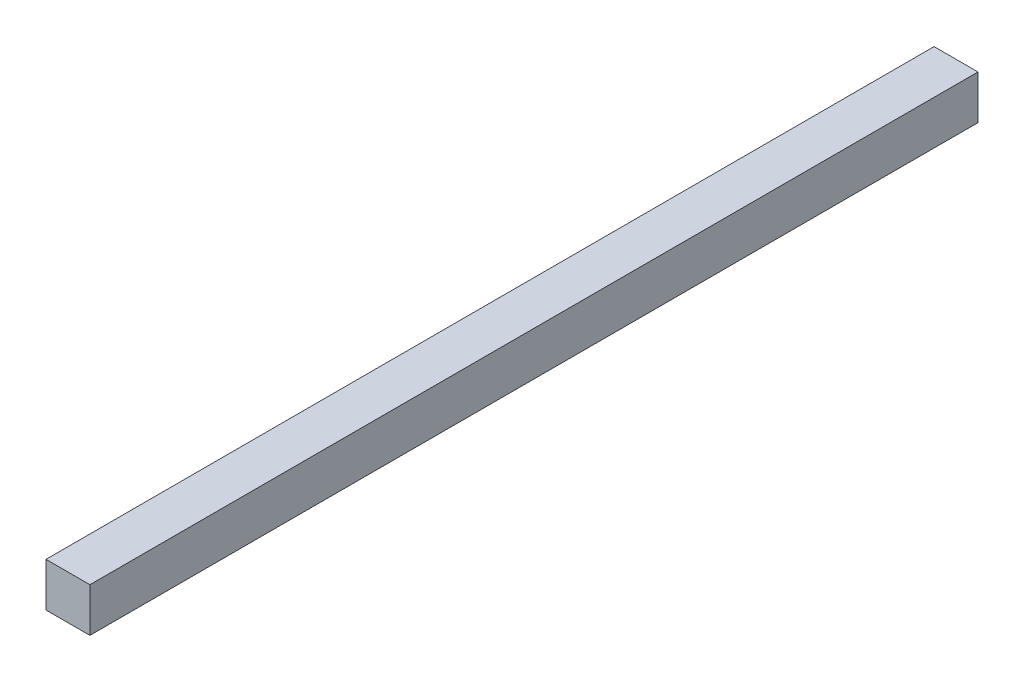
ISO-10303-21;
HEADER;
FILE_DESCRIPTION(('STEP AP214'),'2;1');
FILE_NAME('part.step','',(''),(''),'','','');
FILE_SCHEMA(('AUTOMOTIVE_DESIGN { 1 0 10303 214 1 1 1 1 }'));
ENDSEC;
DATA;
#1=APPLICATION_CONTEXT('core data for automotive mechanical design processes');
#2=APPLICATION_PROTOCOL_DEFINITION('international standard','automotive_design',2000,#1);
#3=PRODUCT_CONTEXT('',#1,'mechanical');
#4=PRODUCT('Part','Part','',(#3));
#5=PRODUCT_RELATED_PRODUCT_CATEGORY('part','',(#4));
#6=PRODUCT_DEFINITION_FORMATION('','',#4);
#7=PRODUCT_DEFINITION_CONTEXT('part definition',#1,'design');
#8=PRODUCT_DEFINITION('design','',#6,#7);
#9=PRODUCT_DEFINITION_SHAPE('','',#8);
#10=(LENGTH_UNIT() NAMED_UNIT(*) SI_UNIT(.MILLI.,.METRE.));
#11=(NAMED_UNIT(*) PLANE_ANGLE_UNIT() SI_UNIT($,.RADIAN.));
#12=(NAMED_UNIT(*) SI_UNIT($,.STERADIAN.) SOLID_ANGLE_UNIT());
#13=UNCERTAINTY_MEASURE_WITH_UNIT(LENGTH_MEASURE(1.E-05),#10,'distance_accuracy_value','');
#14=(GEOMETRIC_REPRESENTATION_CONTEXT(3) GLOBAL_UNCERTAINTY_ASSIGNED_CONTEXT((#13)) GLOBAL_UNIT_ASSIGNED_CONTEXT((#10,
#11,#12)) REPRESENTATION_CONTEXT('',''));
#15=CARTESIAN_POINT('',(0.,0.,0.));
#16=DIRECTION('',(0.,0.,1.));
#17=DIRECTION('',(1.,0.,0.));
#18=AXIS2_PLACEMENT_3D('',#15,#16,#17);
#19=CARTESIAN_POINT('',(0.,0.,910.));
#20=DIRECTION('',(1.,0.,0.));
#21=DIRECTION('',(0.,0.,-1.));
#22=AXIS2_PLACEMENT_3D('',#19,#20,#21);
#23=PLANE('',#22);
#24=DIRECTION('',(0.,-1.,0.));
#25=VECTOR('',#24,1.);
#26=CARTESIAN_POINT('',(0.,0.,0.));
#27=LINE('',#26,#25);
#28=CARTESIAN_POINT('',(0.,45.,0.));
#29=VERTEX_POINT('',#28);
#30=CARTESIAN_POINT('',(0.,0.,0.));
#31=VERTEX_POINT('',#30);
#32=EDGE_CURVE('E107',#29,#31,#27,.T.);
#33=ORIENTED_EDGE('',*,*,#32,.T.);
#34=DIRECTION('',(0.,0.,-1.));
#35=VECTOR('',#34,1.);
#36=CARTESIAN_POINT('',(0.,0.,910.));
#37=LINE('',#36,#35);
#38=CARTESIAN_POINT('',(0.,0.,910.));
#39=VERTEX_POINT('',#38);
#40=EDGE_CURVE('E11',#39,#31,#37,.T.);
#41=ORIENTED_EDGE('',*,*,#40,.F.);
#42=DIRECTION('',(0.,-1.,0.));
#43=VECTOR('',#42,1.);
#44=CARTESIAN_POINT('',(0.,0.,910.));
#45=LINE('',#44,#43);
#46=CARTESIAN_POINT('',(0.,45.,910.));
#47=VERTEX_POINT('',#46);
#48=EDGE_CURVE('E91',#47,#39,#45,.T.);
#49=ORIENTED_EDGE('',*,*,#48,.F.);
#50=DIRECTION('',(0.,0.,-1.));
#51=VECTOR('',#50,1.);
#52=CARTESIAN_POINT('',(0.,45.,910.));
#53=LINE('',#52,#51);
#54=EDGE_CURVE('E103',#47,#29,#53,.T.);
#55=ORIENTED_EDGE('',*,*,#54,.T.);
#56=EDGE_LOOP('',(#33,#41,#49,#55));
#57=FACE_BOUND('',#56,.T.);
#58=ADVANCED_FACE('F39',(#57),#23,.F.);
#59=CARTESIAN_POINT('',(0.,0.,910.));
#60=DIRECTION('',(0.,1.,0.));
#61=DIRECTION('',(0.,0.,1.));
#62=AXIS2_PLACEMENT_3D('',#59,#60,#61);
#63=PLANE('',#62);
#64=DIRECTION('',(1.,0.,0.));
#65=VECTOR('',#64,1.);
#66=CARTESIAN_POINT('',(0.,0.,0.));
#67=LINE('',#66,#65);
#68=CARTESIAN_POINT('',(45.,0.,0.));
#69=VERTEX_POINT('',#68);
#70=EDGE_CURVE('E96',#31,#69,#67,.T.);
#71=ORIENTED_EDGE('',*,*,#70,.T.);
#72=DIRECTION('',(0.,0.,-1.));
#73=VECTOR('',#72,1.);
#74=CARTESIAN_POINT('',(45.,0.,910.));
#75=LINE('',#74,#73);
#76=CARTESIAN_POINT('',(45.,0.,910.));
#77=VERTEX_POINT('',#76);
#78=EDGE_CURVE('E48',#77,#69,#75,.T.);
#79=ORIENTED_EDGE('',*,*,#78,.F.);
#80=DIRECTION('',(1.,0.,0.));
#81=VECTOR('',#80,1.);
#82=CARTESIAN_POINT('',(0.,0.,910.));
#83=LINE('',#82,#81);
#84=EDGE_CURVE('E86',#39,#77,#83,.T.);
#85=ORIENTED_EDGE('',*,*,#84,.F.);
#86=ORIENTED_EDGE('',*,*,#40,.T.);
#87=EDGE_LOOP('',(#71,#79,#85,#86));
#88=FACE_BOUND('',#87,.T.);
#89=ADVANCED_FACE('F95',(#88),#63,.F.);
#90=CARTESIAN_POINT('',(45.,0.,910.));
#91=DIRECTION('',(-1.,0.,0.));
#92=DIRECTION('',(0.,0.,1.));
#93=AXIS2_PLACEMENT_3D('',#90,#91,#92);
#94=PLANE('',#93);
#95=DIRECTION('',(0.,1.,0.));
#96=VECTOR('',#95,1.);
#97=CARTESIAN_POINT('',(45.,0.,0.));
#98=LINE('',#97,#96);
#99=CARTESIAN_POINT('',(45.,45.,0.));
#100=VERTEX_POINT('',#99);
#101=EDGE_CURVE('E73',#69,#100,#98,.T.);
#102=ORIENTED_EDGE('',*,*,#101,.T.);
#103=DIRECTION('',(0.,0.,-1.));
#104=VECTOR('',#103,1.);
#105=CARTESIAN_POINT('',(45.,45.,910.));
#106=LINE('',#105,#104);
#107=CARTESIAN_POINT('',(45.,45.,910.));
#108=VERTEX_POINT('',#107);
#109=EDGE_CURVE('E98',#108,#100,#106,.T.);
#110=ORIENTED_EDGE('',*,*,#109,.F.);
#111=DIRECTION('',(0.,1.,0.));
#112=VECTOR('',#111,1.);
#113=CARTESIAN_POINT('',(45.,0.,910.));
#114=LINE('',#113,#112);
#115=EDGE_CURVE('E89',#77,#108,#114,.T.);
#116=ORIENTED_EDGE('',*,*,#115,.F.);
#117=ORIENTED_EDGE('',*,*,#78,.T.);
#118=EDGE_LOOP('',(#102,#110,#116,#117));
#119=FACE_BOUND('',#118,.T.);
#120=ADVANCED_FACE('F99',(#119),#94,.F.);
#121=CARTESIAN_POINT('',(0.,45.,910.));
#122=DIRECTION('',(0.,-1.,0.));
#123=DIRECTION('',(0.,0.,-1.));
#124=AXIS2_PLACEMENT_3D('',#121,#122,#123);
#125=PLANE('',#124);
#126=DIRECTION('',(-1.,0.,0.));
#127=VECTOR('',#126,1.);
#128=CARTESIAN_POINT('',(0.,45.,0.));
#129=LINE('',#128,#127);
#130=EDGE_CURVE('E79',#100,#29,#129,.T.);
#131=ORIENTED_EDGE('',*,*,#130,.T.);
#132=ORIENTED_EDGE('',*,*,#54,.F.);
#133=DIRECTION('',(-1.,0.,0.));
#134=VECTOR('',#133,1.);
#135=CARTESIAN_POINT('',(0.,45.,910.));
#136=LINE('',#135,#134);
#137=EDGE_CURVE('E56',#108,#47,#136,.T.);
#138=ORIENTED_EDGE('',*,*,#137,.F.);
#139=ORIENTED_EDGE('',*,*,#109,.T.);
#140=EDGE_LOOP('',(#131,#132,#138,#139));
#141=FACE_BOUND('',#140,.T.);
#142=ADVANCED_FACE('F120',(#141),#125,.F.);
#143=CARTESIAN_POINT('',(0.,0.,910.));
#144=DIRECTION('',(0.,0.,-1.));
#145=DIRECTION('',(-1.,0.,0.));
#146=AXIS2_PLACEMENT_3D('',#143,#144,#145);
#147=PLANE('',#146);
#148=ORIENTED_EDGE('',*,*,#48,.T.);
#149=ORIENTED_EDGE('',*,*,#84,.T.);
#150=ORIENTED_EDGE('',*,*,#115,.T.);
#151=ORIENTED_EDGE('',*,*,#137,.T.);
#152=EDGE_LOOP('',(#148,#149,#150,#151));
#153=FACE_BOUND('',#152,.T.);
#154=ADVANCED_FACE('F87',(#153),#147,.F.);
#155=CARTESIAN_POINT('',(0.,0.,0.));
#156=DIRECTION('',(0.,0.,-1.));
#157=DIRECTION('',(-1.,0.,0.));
#158=AXIS2_PLACEMENT_3D('',#155,#156,#157);
#159=PLANE('',#158);
#160=ORIENTED_EDGE('',*,*,#32,.F.);
#161=ORIENTED_EDGE('',*,*,#130,.F.);
#162=ORIENTED_EDGE('',*,*,#101,.F.);
#163=ORIENTED_EDGE('',*,*,#70,.F.);
#164=EDGE_LOOP('',(#160,#161,#162,#163));
#165=FACE_BOUND('',#164,.T.);
#166=ADVANCED_FACE('F123',(#165),#159,.T.);
#167=CLOSED_SHELL('',(#58,#89,#120,#142,#154,#166));
#168=MANIFOLD_SOLID_BREP('B2',#167);
#169=ADVANCED_BREP_SHAPE_REPRESENTATION('',(#18,#168),#14);
#170=SHAPE_DEFINITION_REPRESENTATION(#9,#169);
ENDSEC;
END-ISO-10303-21;
